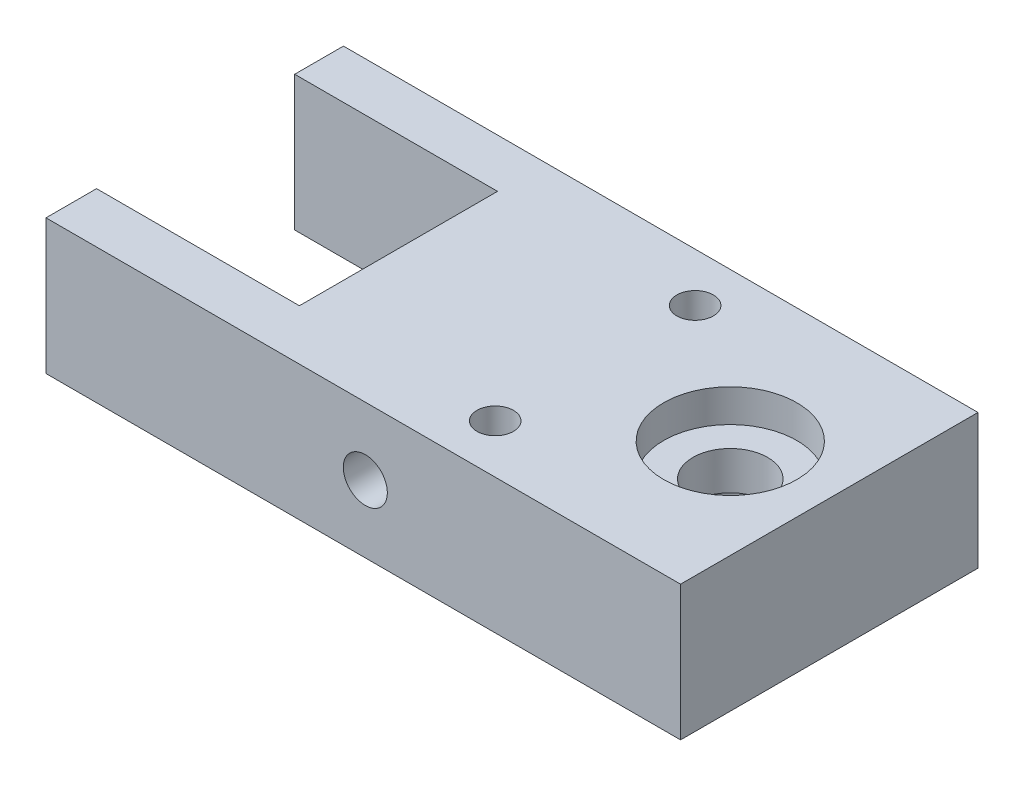
ISO-10303-21;
HEADER;
FILE_DESCRIPTION(('STEP AP214'),'2;1');
FILE_NAME('part.step','',(''),(''),'','','');
FILE_SCHEMA(('AUTOMOTIVE_DESIGN { 1 0 10303 214 1 1 1 1 }'));
ENDSEC;
DATA;
#1=APPLICATION_CONTEXT('core data for automotive mechanical design processes');
#2=APPLICATION_PROTOCOL_DEFINITION('international standard','automotive_design',2000,#1);
#3=PRODUCT_CONTEXT('',#1,'mechanical');
#4=PRODUCT('Part','Part','',(#3));
#5=PRODUCT_RELATED_PRODUCT_CATEGORY('part','',(#4));
#6=PRODUCT_DEFINITION_FORMATION('','',#4);
#7=PRODUCT_DEFINITION_CONTEXT('part definition',#1,'design');
#8=PRODUCT_DEFINITION('design','',#6,#7);
#9=PRODUCT_DEFINITION_SHAPE('','',#8);
#10=(LENGTH_UNIT() NAMED_UNIT(*) SI_UNIT(.MILLI.,.METRE.));
#11=(NAMED_UNIT(*) PLANE_ANGLE_UNIT() SI_UNIT($,.RADIAN.));
#12=(NAMED_UNIT(*) SI_UNIT($,.STERADIAN.) SOLID_ANGLE_UNIT());
#13=UNCERTAINTY_MEASURE_WITH_UNIT(LENGTH_MEASURE(1.E-05),#10,'distance_accuracy_value','');
#14=(GEOMETRIC_REPRESENTATION_CONTEXT(3) GLOBAL_UNCERTAINTY_ASSIGNED_CONTEXT((#13)) GLOBAL_UNIT_ASSIGNED_CONTEXT((#10,
#11,#12)) REPRESENTATION_CONTEXT('',''));
#15=CARTESIAN_POINT('',(0.,0.,0.));
#16=DIRECTION('',(0.,0.,1.));
#17=DIRECTION('',(1.,0.,0.));
#18=AXIS2_PLACEMENT_3D('',#15,#16,#17);
#19=CARTESIAN_POINT('',(0.,12.86,0.));
#20=DIRECTION('',(0.,-1.,0.));
#21=DIRECTION('',(0.,0.,-1.));
#22=AXIS2_PLACEMENT_3D('',#19,#20,#21);
#23=CYLINDRICAL_SURFACE('',#22,3.56);
#24=CARTESIAN_POINT('',(0.,9.74,0.));
#25=DIRECTION('',(0.,1.,0.));
#26=DIRECTION('',(0.,0.,1.));
#27=AXIS2_PLACEMENT_3D('',#24,#25,#26);
#28=CIRCLE('',#27,3.56);
#29=CARTESIAN_POINT('',(0.,9.74,3.56));
#30=VERTEX_POINT('',#29);
#31=EDGE_CURVE('E158',#30,#30,#28,.T.);
#32=ORIENTED_EDGE('',*,*,#31,.T.);
#33=EDGE_LOOP('',(#32));
#34=FACE_BOUND('',#33,.T.);
#35=CARTESIAN_POINT('',(0.,6.08,0.));
#36=DIRECTION('',(0.,-1.,0.));
#37=DIRECTION('',(0.,0.,-1.));
#38=AXIS2_PLACEMENT_3D('',#35,#36,#37);
#39=CIRCLE('',#38,3.56);
#40=CARTESIAN_POINT('',(0.,6.08,-3.56));
#41=VERTEX_POINT('',#40);
#42=EDGE_CURVE('E37',#41,#41,#39,.T.);
#43=ORIENTED_EDGE('',*,*,#42,.T.);
#44=EDGE_LOOP('',(#43));
#45=FACE_BOUND('',#44,.T.);
#46=ADVANCED_FACE('F33',(#34,#45),#23,.F.);
#47=CARTESIAN_POINT('',(-31.72,12.86,-9.52999999999999));
#48=DIRECTION('',(0.,-1.,0.));
#49=DIRECTION('',(0.,0.,-1.));
#50=AXIS2_PLACEMENT_3D('',#47,#48,#49);
#51=PLANE('',#50);
#52=CARTESIAN_POINT('',(-12.88,12.86,9.53));
#53=DIRECTION('',(0.,-1.,0.));
#54=DIRECTION('',(0.,0.,-1.));
#55=AXIS2_PLACEMENT_3D('',#52,#53,#54);
#56=CIRCLE('',#55,1.74);
#57=CARTESIAN_POINT('',(-12.88,12.86,7.79));
#58=VERTEX_POINT('',#57);
#59=EDGE_CURVE('E247',#58,#58,#56,.T.);
#60=ORIENTED_EDGE('',*,*,#59,.T.);
#61=EDGE_LOOP('',(#60));
#62=FACE_BOUND('',#61,.T.);
#63=CARTESIAN_POINT('',(-12.88,12.86,-9.53));
#64=DIRECTION('',(0.,-1.,0.));
#65=DIRECTION('',(0.,0.,-1.));
#66=AXIS2_PLACEMENT_3D('',#63,#64,#65);
#67=CIRCLE('',#66,1.74);
#68=CARTESIAN_POINT('',(-12.88,12.86,-11.27));
#69=VERTEX_POINT('',#68);
#70=EDGE_CURVE('E241',#69,#69,#67,.T.);
#71=ORIENTED_EDGE('',*,*,#70,.T.);
#72=EDGE_LOOP('',(#71));
#73=FACE_BOUND('',#72,.T.);
#74=CARTESIAN_POINT('',(0.,12.86,0.));
#75=DIRECTION('',(0.,1.,0.));
#76=DIRECTION('',(0.,0.,1.));
#77=AXIS2_PLACEMENT_3D('',#74,#75,#76);
#78=CIRCLE('',#77,6.35);
#79=CARTESIAN_POINT('',(0.,12.86,6.35));
#80=VERTEX_POINT('',#79);
#81=EDGE_CURVE('E167',#80,#80,#78,.T.);
#82=ORIENTED_EDGE('',*,*,#81,.F.);
#83=EDGE_LOOP('',(#82));
#84=FACE_BOUND('',#83,.T.);
#85=DIRECTION('',(1.,0.,0.));
#86=VECTOR('',#85,1.);
#87=CARTESIAN_POINT('',(-51.06,12.86,-9.52999999999999));
#88=LINE('',#87,#86);
#89=CARTESIAN_POINT('',(-51.06,12.86,-9.52999999999999));
#90=VERTEX_POINT('',#89);
#91=CARTESIAN_POINT('',(-31.72,12.86,-9.52999999999999));
#92=VERTEX_POINT('',#91);
#93=EDGE_CURVE('E147',#90,#92,#88,.T.);
#94=ORIENTED_EDGE('',*,*,#93,.T.);
#95=DIRECTION('',(0.,0.,1.));
#96=VECTOR('',#95,1.);
#97=CARTESIAN_POINT('',(-31.72,12.86,-9.52999999999999));
#98=LINE('',#97,#96);
#99=CARTESIAN_POINT('',(-31.72,12.86,9.36));
#100=VERTEX_POINT('',#99);
#101=EDGE_CURVE('E95',#92,#100,#98,.T.);
#102=ORIENTED_EDGE('',*,*,#101,.T.);
#103=DIRECTION('',(-1.,0.,0.));
#104=VECTOR('',#103,1.);
#105=CARTESIAN_POINT('',(-31.72,12.86,9.36));
#106=LINE('',#105,#104);
#107=CARTESIAN_POINT('',(-51.06,12.86,9.36000000000001));
#108=VERTEX_POINT('',#107);
#109=EDGE_CURVE('E181',#100,#108,#106,.T.);
#110=ORIENTED_EDGE('',*,*,#109,.T.);
#111=DIRECTION('',(0.,0.,1.));
#112=VECTOR('',#111,1.);
#113=CARTESIAN_POINT('',(-51.06,12.86,9.36000000000001));
#114=LINE('',#113,#112);
#115=CARTESIAN_POINT('',(-51.06,12.86,14.18));
#116=VERTEX_POINT('',#115);
#117=EDGE_CURVE('E183',#108,#116,#114,.T.);
#118=ORIENTED_EDGE('',*,*,#117,.T.);
#119=DIRECTION('',(1.,0.,0.));
#120=VECTOR('',#119,1.);
#121=CARTESIAN_POINT('',(-51.06,12.86,14.18));
#122=LINE('',#121,#120);
#123=CARTESIAN_POINT('',(9.43999999999999,12.86,14.18));
#124=VERTEX_POINT('',#123);
#125=EDGE_CURVE('E114',#116,#124,#122,.T.);
#126=ORIENTED_EDGE('',*,*,#125,.T.);
#127=DIRECTION('',(0.,0.,-1.));
#128=VECTOR('',#127,1.);
#129=CARTESIAN_POINT('',(9.43999999999999,12.86,14.18));
#130=LINE('',#129,#128);
#131=CARTESIAN_POINT('',(9.43999999999998,12.86,-14.18));
#132=VERTEX_POINT('',#131);
#133=EDGE_CURVE('E108',#124,#132,#130,.T.);
#134=ORIENTED_EDGE('',*,*,#133,.T.);
#135=DIRECTION('',(-1.,0.,0.));
#136=VECTOR('',#135,1.);
#137=CARTESIAN_POINT('',(9.43999999999998,12.86,-14.18));
#138=LINE('',#137,#136);
#139=CARTESIAN_POINT('',(-51.06,12.86,-14.18));
#140=VERTEX_POINT('',#139);
#141=EDGE_CURVE('E112',#132,#140,#138,.T.);
#142=ORIENTED_EDGE('',*,*,#141,.T.);
#143=DIRECTION('',(0.,0.,1.));
#144=VECTOR('',#143,1.);
#145=CARTESIAN_POINT('',(-51.06,12.86,-14.18));
#146=LINE('',#145,#144);
#147=EDGE_CURVE('E52',#140,#90,#146,.T.);
#148=ORIENTED_EDGE('',*,*,#147,.T.);
#149=EDGE_LOOP('',(#94,#102,#110,#118,#126,#134,#142,#148));
#150=FACE_BOUND('',#149,.T.);
#151=ADVANCED_FACE('F110',(#62,#73,#84,#150),#51,.F.);
#152=CARTESIAN_POINT('',(-31.72,0.,-9.52999999999999));
#153=DIRECTION('',(0.,-1.,0.));
#154=DIRECTION('',(0.,0.,-1.));
#155=AXIS2_PLACEMENT_3D('',#152,#153,#154);
#156=PLANE('',#155);
#157=CARTESIAN_POINT('',(-12.88,0.,9.53));
#158=DIRECTION('',(0.,-1.,0.));
#159=DIRECTION('',(0.,0.,-1.));
#160=AXIS2_PLACEMENT_3D('',#157,#158,#159);
#161=CIRCLE('',#160,1.74);
#162=CARTESIAN_POINT('',(-12.88,0.,7.79));
#163=VERTEX_POINT('',#162);
#164=EDGE_CURVE('E232',#163,#163,#161,.T.);
#165=ORIENTED_EDGE('',*,*,#164,.F.);
#166=EDGE_LOOP('',(#165));
#167=FACE_BOUND('',#166,.T.);
#168=CARTESIAN_POINT('',(-12.88,0.,-9.53));
#169=DIRECTION('',(0.,-1.,0.));
#170=DIRECTION('',(0.,0.,-1.));
#171=AXIS2_PLACEMENT_3D('',#168,#169,#170);
#172=CIRCLE('',#171,1.74);
#173=CARTESIAN_POINT('',(-12.88,0.,-11.27));
#174=VERTEX_POINT('',#173);
#175=EDGE_CURVE('E236',#174,#174,#172,.T.);
#176=ORIENTED_EDGE('',*,*,#175,.F.);
#177=EDGE_LOOP('',(#176));
#178=FACE_BOUND('',#177,.T.);
#179=CARTESIAN_POINT('',(0.,0.,0.));
#180=DIRECTION('',(0.,-1.,0.));
#181=DIRECTION('',(0.,0.,-1.));
#182=AXIS2_PLACEMENT_3D('',#179,#180,#181);
#183=CIRCLE('',#182,5.57);
#184=CARTESIAN_POINT('',(0.,0.,-5.57));
#185=VERTEX_POINT('',#184);
#186=EDGE_CURVE('E174',#185,#185,#183,.T.);
#187=ORIENTED_EDGE('',*,*,#186,.F.);
#188=EDGE_LOOP('',(#187));
#189=FACE_BOUND('',#188,.T.);
#190=DIRECTION('',(1.,0.,0.));
#191=VECTOR('',#190,1.);
#192=CARTESIAN_POINT('',(-51.06,0.,-9.52999999999999));
#193=LINE('',#192,#191);
#194=CARTESIAN_POINT('',(-51.06,0.,-9.52999999999999));
#195=VERTEX_POINT('',#194);
#196=CARTESIAN_POINT('',(-31.72,0.,-9.52999999999999));
#197=VERTEX_POINT('',#196);
#198=EDGE_CURVE('E132',#195,#197,#193,.T.);
#199=ORIENTED_EDGE('',*,*,#198,.F.);
#200=DIRECTION('',(0.,0.,1.));
#201=VECTOR('',#200,1.);
#202=CARTESIAN_POINT('',(-51.06,0.,-14.18));
#203=LINE('',#202,#201);
#204=CARTESIAN_POINT('',(-51.06,0.,-14.18));
#205=VERTEX_POINT('',#204);
#206=EDGE_CURVE('E87',#205,#195,#203,.T.);
#207=ORIENTED_EDGE('',*,*,#206,.F.);
#208=DIRECTION('',(-1.,0.,0.));
#209=VECTOR('',#208,1.);
#210=CARTESIAN_POINT('',(9.43999999999998,0.,-14.18));
#211=LINE('',#210,#209);
#212=CARTESIAN_POINT('',(9.43999999999998,0.,-14.18));
#213=VERTEX_POINT('',#212);
#214=EDGE_CURVE('E81',#213,#205,#211,.T.);
#215=ORIENTED_EDGE('',*,*,#214,.F.);
#216=DIRECTION('',(0.,0.,-1.));
#217=VECTOR('',#216,1.);
#218=CARTESIAN_POINT('',(9.43999999999999,0.,14.18));
#219=LINE('',#218,#217);
#220=CARTESIAN_POINT('',(9.43999999999999,0.,14.18));
#221=VERTEX_POINT('',#220);
#222=EDGE_CURVE('E122',#221,#213,#219,.T.);
#223=ORIENTED_EDGE('',*,*,#222,.F.);
#224=DIRECTION('',(1.,0.,0.));
#225=VECTOR('',#224,1.);
#226=CARTESIAN_POINT('',(-51.06,0.,14.18));
#227=LINE('',#226,#225);
#228=CARTESIAN_POINT('',(-51.06,0.,14.18));
#229=VERTEX_POINT('',#228);
#230=EDGE_CURVE('E142',#229,#221,#227,.T.);
#231=ORIENTED_EDGE('',*,*,#230,.F.);
#232=DIRECTION('',(0.,0.,1.));
#233=VECTOR('',#232,1.);
#234=CARTESIAN_POINT('',(-51.06,0.,9.36000000000001));
#235=LINE('',#234,#233);
#236=CARTESIAN_POINT('',(-51.06,0.,9.36000000000001));
#237=VERTEX_POINT('',#236);
#238=EDGE_CURVE('E140',#237,#229,#235,.T.);
#239=ORIENTED_EDGE('',*,*,#238,.F.);
#240=DIRECTION('',(-1.,0.,0.));
#241=VECTOR('',#240,1.);
#242=CARTESIAN_POINT('',(-31.72,0.,9.36));
#243=LINE('',#242,#241);
#244=CARTESIAN_POINT('',(-31.72,0.,9.36));
#245=VERTEX_POINT('',#244);
#246=EDGE_CURVE('E138',#245,#237,#243,.T.);
#247=ORIENTED_EDGE('',*,*,#246,.F.);
#248=DIRECTION('',(0.,0.,1.));
#249=VECTOR('',#248,1.);
#250=CARTESIAN_POINT('',(-31.72,0.,-9.52999999999999));
#251=LINE('',#250,#249);
#252=EDGE_CURVE('E135',#197,#245,#251,.T.);
#253=ORIENTED_EDGE('',*,*,#252,.F.);
#254=EDGE_LOOP('',(#199,#207,#215,#223,#231,#239,#247,#253));
#255=FACE_BOUND('',#254,.T.);
#256=ADVANCED_FACE('F196',(#167,#178,#189,#255),#156,.T.);
#257=CARTESIAN_POINT('',(-51.06,12.86,-9.52999999999999));
#258=DIRECTION('',(0.,0.,-1.));
#259=DIRECTION('',(-1.,0.,0.));
#260=AXIS2_PLACEMENT_3D('',#257,#258,#259);
#261=PLANE('',#260);
#262=ORIENTED_EDGE('',*,*,#198,.T.);
#263=DIRECTION('',(0.,-1.,0.));
#264=VECTOR('',#263,1.);
#265=CARTESIAN_POINT('',(-31.72,12.86,-9.52999999999999));
#266=LINE('',#265,#264);
#267=EDGE_CURVE('E11',#92,#197,#266,.T.);
#268=ORIENTED_EDGE('',*,*,#267,.F.);
#269=ORIENTED_EDGE('',*,*,#93,.F.);
#270=DIRECTION('',(0.,-1.,0.));
#271=VECTOR('',#270,1.);
#272=CARTESIAN_POINT('',(-51.06,12.86,-9.52999999999999));
#273=LINE('',#272,#271);
#274=EDGE_CURVE('E128',#90,#195,#273,.T.);
#275=ORIENTED_EDGE('',*,*,#274,.T.);
#276=EDGE_LOOP('',(#262,#268,#269,#275));
#277=FACE_BOUND('',#276,.T.);
#278=ADVANCED_FACE('F35',(#277),#261,.F.);
#279=CARTESIAN_POINT('',(-31.72,12.86,-9.52999999999999));
#280=DIRECTION('',(1.,0.,0.));
#281=DIRECTION('',(0.,0.,-1.));
#282=AXIS2_PLACEMENT_3D('',#279,#280,#281);
#283=PLANE('',#282);
#284=CARTESIAN_POINT('',(-31.72,6.43,-0.0849999999999939));
#285=DIRECTION('',(-1.,0.,0.));
#286=DIRECTION('',(0.,0.,1.));
#287=AXIS2_PLACEMENT_3D('',#284,#285,#286);
#288=CIRCLE('',#287,2.085);
#289=CARTESIAN_POINT('',(-31.72,6.43,2.00000000000001));
#290=VERTEX_POINT('',#289);
#291=EDGE_CURVE('E160',#290,#290,#288,.T.);
#292=ORIENTED_EDGE('',*,*,#291,.F.);
#293=EDGE_LOOP('',(#292));
#294=FACE_BOUND('',#293,.T.);
#295=ORIENTED_EDGE('',*,*,#252,.T.);
#296=DIRECTION('',(0.,-1.,0.));
#297=VECTOR('',#296,1.);
#298=CARTESIAN_POINT('',(-31.72,12.86,9.36));
#299=LINE('',#298,#297);
#300=EDGE_CURVE('E43',#100,#245,#299,.T.);
#301=ORIENTED_EDGE('',*,*,#300,.F.);
#302=ORIENTED_EDGE('',*,*,#101,.F.);
#303=ORIENTED_EDGE('',*,*,#267,.T.);
#304=EDGE_LOOP('',(#295,#301,#302,#303));
#305=FACE_BOUND('',#304,.T.);
#306=ADVANCED_FACE('F228',(#294,#305),#283,.F.);
#307=CARTESIAN_POINT('',(-31.72,12.86,9.36));
#308=DIRECTION('',(0.,0.,1.));
#309=DIRECTION('',(1.,0.,0.));
#310=AXIS2_PLACEMENT_3D('',#307,#308,#309);
#311=PLANE('',#310);
#312=ORIENTED_EDGE('',*,*,#246,.T.);
#313=DIRECTION('',(0.,-1.,0.));
#314=VECTOR('',#313,1.);
#315=CARTESIAN_POINT('',(-51.06,12.86,9.36000000000001));
#316=LINE('',#315,#314);
#317=EDGE_CURVE('E154',#108,#237,#316,.T.);
#318=ORIENTED_EDGE('',*,*,#317,.F.);
#319=ORIENTED_EDGE('',*,*,#109,.F.);
#320=ORIENTED_EDGE('',*,*,#300,.T.);
#321=EDGE_LOOP('',(#312,#318,#319,#320));
#322=FACE_BOUND('',#321,.T.);
#323=ADVANCED_FACE('F276',(#322),#311,.F.);
#324=CARTESIAN_POINT('',(-51.06,12.86,9.36000000000001));
#325=DIRECTION('',(1.,0.,0.));
#326=DIRECTION('',(0.,0.,-1.));
#327=AXIS2_PLACEMENT_3D('',#324,#325,#326);
#328=PLANE('',#327);
#329=ORIENTED_EDGE('',*,*,#238,.T.);
#330=DIRECTION('',(0.,-1.,0.));
#331=VECTOR('',#330,1.);
#332=CARTESIAN_POINT('',(-51.06,12.86,14.18));
#333=LINE('',#332,#331);
#334=EDGE_CURVE('E151',#116,#229,#333,.T.);
#335=ORIENTED_EDGE('',*,*,#334,.F.);
#336=ORIENTED_EDGE('',*,*,#117,.F.);
#337=ORIENTED_EDGE('',*,*,#317,.T.);
#338=EDGE_LOOP('',(#329,#335,#336,#337));
#339=FACE_BOUND('',#338,.T.);
#340=ADVANCED_FACE('F189',(#339),#328,.F.);
#341=CARTESIAN_POINT('',(-51.06,12.86,14.18));
#342=DIRECTION('',(0.,0.,-1.));
#343=DIRECTION('',(-1.,0.,0.));
#344=AXIS2_PLACEMENT_3D('',#341,#342,#343);
#345=PLANE('',#344);
#346=CARTESIAN_POINT('',(-20.615,6.43,14.18));
#347=DIRECTION('',(0.,0.,1.));
#348=DIRECTION('',(1.,0.,0.));
#349=AXIS2_PLACEMENT_3D('',#346,#347,#348);
#350=CIRCLE('',#349,2.1);
#351=CARTESIAN_POINT('',(-18.515,6.43,14.18));
#352=VERTEX_POINT('',#351);
#353=EDGE_CURVE('E254',#352,#352,#350,.T.);
#354=ORIENTED_EDGE('',*,*,#353,.F.);
#355=EDGE_LOOP('',(#354));
#356=FACE_BOUND('',#355,.T.);
#357=ORIENTED_EDGE('',*,*,#230,.T.);
#358=DIRECTION('',(0.,-1.,0.));
#359=VECTOR('',#358,1.);
#360=CARTESIAN_POINT('',(9.43999999999999,12.86,14.18));
#361=LINE('',#360,#359);
#362=EDGE_CURVE('E123',#124,#221,#361,.T.);
#363=ORIENTED_EDGE('',*,*,#362,.F.);
#364=ORIENTED_EDGE('',*,*,#125,.F.);
#365=ORIENTED_EDGE('',*,*,#334,.T.);
#366=EDGE_LOOP('',(#357,#363,#364,#365));
#367=FACE_BOUND('',#366,.T.);
#368=ADVANCED_FACE('F193',(#356,#367),#345,.F.);
#369=CARTESIAN_POINT('',(9.43999999999999,12.86,14.18));
#370=DIRECTION('',(-1.,0.,0.));
#371=DIRECTION('',(0.,0.,1.));
#372=AXIS2_PLACEMENT_3D('',#369,#370,#371);
#373=PLANE('',#372);
#374=ORIENTED_EDGE('',*,*,#222,.T.);
#375=DIRECTION('',(0.,-1.,0.));
#376=VECTOR('',#375,1.);
#377=CARTESIAN_POINT('',(9.43999999999998,12.86,-14.18));
#378=LINE('',#377,#376);
#379=EDGE_CURVE('E119',#132,#213,#378,.T.);
#380=ORIENTED_EDGE('',*,*,#379,.F.);
#381=ORIENTED_EDGE('',*,*,#133,.F.);
#382=ORIENTED_EDGE('',*,*,#362,.T.);
#383=EDGE_LOOP('',(#374,#380,#381,#382));
#384=FACE_BOUND('',#383,.T.);
#385=ADVANCED_FACE('F120',(#384),#373,.F.);
#386=CARTESIAN_POINT('',(9.43999999999998,12.86,-14.18));
#387=DIRECTION('',(0.,0.,1.));
#388=DIRECTION('',(1.,0.,0.));
#389=AXIS2_PLACEMENT_3D('',#386,#387,#388);
#390=PLANE('',#389);
#391=ORIENTED_EDGE('',*,*,#214,.T.);
#392=DIRECTION('',(0.,-1.,0.));
#393=VECTOR('',#392,1.);
#394=CARTESIAN_POINT('',(-51.06,12.86,-14.18));
#395=LINE('',#394,#393);
#396=EDGE_CURVE('E124',#140,#205,#395,.T.);
#397=ORIENTED_EDGE('',*,*,#396,.F.);
#398=ORIENTED_EDGE('',*,*,#141,.F.);
#399=ORIENTED_EDGE('',*,*,#379,.T.);
#400=EDGE_LOOP('',(#391,#397,#398,#399));
#401=FACE_BOUND('',#400,.T.);
#402=ADVANCED_FACE('F126',(#401),#390,.F.);
#403=CARTESIAN_POINT('',(-51.06,12.86,-14.18));
#404=DIRECTION('',(1.,0.,0.));
#405=DIRECTION('',(0.,0.,-1.));
#406=AXIS2_PLACEMENT_3D('',#403,#404,#405);
#407=PLANE('',#406);
#408=ORIENTED_EDGE('',*,*,#206,.T.);
#409=ORIENTED_EDGE('',*,*,#274,.F.);
#410=ORIENTED_EDGE('',*,*,#147,.F.);
#411=ORIENTED_EDGE('',*,*,#396,.T.);
#412=EDGE_LOOP('',(#408,#409,#410,#411));
#413=FACE_BOUND('',#412,.T.);
#414=ADVANCED_FACE('F201',(#413),#407,.F.);
#415=CARTESIAN_POINT('',(-19.02,6.43,-0.0849999999999939));
#416=DIRECTION('',(-1.,0.,0.));
#417=DIRECTION('',(0.,0.,1.));
#418=AXIS2_PLACEMENT_3D('',#415,#416,#417);
#419=CYLINDRICAL_SURFACE('',#418,2.085);
#420=CARTESIAN_POINT('',(-19.02,6.43,-0.0849999999999939));
#421=DIRECTION('',(-1.,0.,0.));
#422=DIRECTION('',(0.,0.,1.));
#423=AXIS2_PLACEMENT_3D('',#420,#421,#422);
#424=CIRCLE('',#423,2.085);
#425=CARTESIAN_POINT('',(-19.02,6.43,2.00000000000001));
#426=VERTEX_POINT('',#425);
#427=EDGE_CURVE('E136',#426,#426,#424,.T.);
#428=ORIENTED_EDGE('',*,*,#427,.F.);
#429=EDGE_LOOP('',(#428));
#430=FACE_BOUND('',#429,.T.);
#431=ORIENTED_EDGE('',*,*,#291,.T.);
#432=EDGE_LOOP('',(#431));
#433=FACE_BOUND('',#432,.T.);
#434=ADVANCED_FACE('F203',(#430,#433),#419,.F.);
#435=CARTESIAN_POINT('',(-19.02,6.43,-0.0849999999999939));
#436=DIRECTION('',(-1.,0.,0.));
#437=DIRECTION('',(0.,0.,1.));
#438=AXIS2_PLACEMENT_3D('',#435,#436,#437);
#439=PLANE('',#438);
#440=ORIENTED_EDGE('',*,*,#427,.T.);
#441=EDGE_LOOP('',(#440));
#442=FACE_BOUND('',#441,.T.);
#443=ADVANCED_FACE('F209',(#442),#439,.T.);
#444=CARTESIAN_POINT('',(0.,9.74,0.));
#445=DIRECTION('',(0.,1.,0.));
#446=DIRECTION('',(0.,0.,1.));
#447=AXIS2_PLACEMENT_3D('',#444,#445,#446);
#448=CYLINDRICAL_SURFACE('',#447,6.35);
#449=CARTESIAN_POINT('',(0.,9.74,0.));
#450=DIRECTION('',(0.,1.,0.));
#451=DIRECTION('',(0.,0.,1.));
#452=AXIS2_PLACEMENT_3D('',#449,#450,#451);
#453=CIRCLE('',#452,6.35);
#454=CARTESIAN_POINT('',(0.,9.74,6.35));
#455=VERTEX_POINT('',#454);
#456=EDGE_CURVE('E161',#455,#455,#453,.T.);
#457=ORIENTED_EDGE('',*,*,#456,.F.);
#458=EDGE_LOOP('',(#457));
#459=FACE_BOUND('',#458,.T.);
#460=ORIENTED_EDGE('',*,*,#81,.T.);
#461=EDGE_LOOP('',(#460));
#462=FACE_BOUND('',#461,.T.);
#463=ADVANCED_FACE('F329',(#459,#462),#448,.F.);
#464=CARTESIAN_POINT('',(0.,9.74,0.));
#465=DIRECTION('',(0.,1.,0.));
#466=DIRECTION('',(0.,0.,1.));
#467=AXIS2_PLACEMENT_3D('',#464,#465,#466);
#468=PLANE('',#467);
#469=ORIENTED_EDGE('',*,*,#31,.F.);
#470=EDGE_LOOP('',(#469));
#471=FACE_BOUND('',#470,.T.);
#472=ORIENTED_EDGE('',*,*,#456,.T.);
#473=EDGE_LOOP('',(#472));
#474=FACE_BOUND('',#473,.T.);
#475=ADVANCED_FACE('F337',(#471,#474),#468,.T.);
#476=CARTESIAN_POINT('',(0.,6.08,0.));
#477=DIRECTION('',(0.,-1.,0.));
#478=DIRECTION('',(0.,0.,-1.));
#479=AXIS2_PLACEMENT_3D('',#476,#477,#478);
#480=CYLINDRICAL_SURFACE('',#479,5.57);
#481=CARTESIAN_POINT('',(0.,6.08,0.));
#482=DIRECTION('',(0.,-1.,0.));
#483=DIRECTION('',(0.,0.,-1.));
#484=AXIS2_PLACEMENT_3D('',#481,#482,#483);
#485=CIRCLE('',#484,5.57);
#486=CARTESIAN_POINT('',(0.,6.08,-5.57));
#487=VERTEX_POINT('',#486);
#488=EDGE_CURVE('E240',#487,#487,#485,.T.);
#489=ORIENTED_EDGE('',*,*,#488,.F.);
#490=EDGE_LOOP('',(#489));
#491=FACE_BOUND('',#490,.T.);
#492=ORIENTED_EDGE('',*,*,#186,.T.);
#493=EDGE_LOOP('',(#492));
#494=FACE_BOUND('',#493,.T.);
#495=ADVANCED_FACE('F346',(#491,#494),#480,.F.);
#496=CARTESIAN_POINT('',(0.,6.08,0.));
#497=DIRECTION('',(0.,-1.,0.));
#498=DIRECTION('',(0.,0.,-1.));
#499=AXIS2_PLACEMENT_3D('',#496,#497,#498);
#500=PLANE('',#499);
#501=ORIENTED_EDGE('',*,*,#42,.F.);
#502=EDGE_LOOP('',(#501));
#503=FACE_BOUND('',#502,.T.);
#504=ORIENTED_EDGE('',*,*,#488,.T.);
#505=EDGE_LOOP('',(#504));
#506=FACE_BOUND('',#505,.T.);
#507=ADVANCED_FACE('F359',(#503,#506),#500,.T.);
#508=CARTESIAN_POINT('',(-12.88,12.86,-9.53));
#509=DIRECTION('',(0.,-1.,0.));
#510=DIRECTION('',(0.,0.,-1.));
#511=AXIS2_PLACEMENT_3D('',#508,#509,#510);
#512=CYLINDRICAL_SURFACE('',#511,1.74);
#513=ORIENTED_EDGE('',*,*,#70,.F.);
#514=EDGE_LOOP('',(#513));
#515=FACE_BOUND('',#514,.T.);
#516=ORIENTED_EDGE('',*,*,#175,.T.);
#517=EDGE_LOOP('',(#516));
#518=FACE_BOUND('',#517,.T.);
#519=ADVANCED_FACE('F368',(#515,#518),#512,.F.);
#520=CARTESIAN_POINT('',(-12.88,12.86,9.53));
#521=DIRECTION('',(0.,-1.,0.));
#522=DIRECTION('',(0.,0.,-1.));
#523=AXIS2_PLACEMENT_3D('',#520,#521,#522);
#524=CYLINDRICAL_SURFACE('',#523,1.74);
#525=ORIENTED_EDGE('',*,*,#59,.F.);
#526=EDGE_LOOP('',(#525));
#527=FACE_BOUND('',#526,.T.);
#528=ORIENTED_EDGE('',*,*,#164,.T.);
#529=EDGE_LOOP('',(#528));
#530=FACE_BOUND('',#529,.T.);
#531=ADVANCED_FACE('F265',(#527,#530),#524,.F.);
#532=CARTESIAN_POINT('',(-20.615,6.43,4.18));
#533=DIRECTION('',(0.,0.,1.));
#534=DIRECTION('',(1.,0.,0.));
#535=AXIS2_PLACEMENT_3D('',#532,#533,#534);
#536=CYLINDRICAL_SURFACE('',#535,2.1);
#537=CARTESIAN_POINT('',(-20.615,6.43,4.18));
#538=DIRECTION('',(0.,0.,1.));
#539=DIRECTION('',(1.,0.,0.));
#540=AXIS2_PLACEMENT_3D('',#537,#538,#539);
#541=CIRCLE('',#540,2.1);
#542=CARTESIAN_POINT('',(-18.515,6.43,4.18));
#543=VERTEX_POINT('',#542);
#544=EDGE_CURVE('E251',#543,#543,#541,.T.);
#545=ORIENTED_EDGE('',*,*,#544,.F.);
#546=EDGE_LOOP('',(#545));
#547=FACE_BOUND('',#546,.T.);
#548=ORIENTED_EDGE('',*,*,#353,.T.);
#549=EDGE_LOOP('',(#548));
#550=FACE_BOUND('',#549,.T.);
#551=ADVANCED_FACE('F262',(#547,#550),#536,.F.);
#552=CARTESIAN_POINT('',(-20.615,6.43,4.18));
#553=DIRECTION('',(0.,0.,1.));
#554=DIRECTION('',(1.,0.,0.));
#555=AXIS2_PLACEMENT_3D('',#552,#553,#554);
#556=PLANE('',#555);
#557=ORIENTED_EDGE('',*,*,#544,.T.);
#558=EDGE_LOOP('',(#557));
#559=FACE_BOUND('',#558,.T.);
#560=ADVANCED_FACE('F260',(#559),#556,.T.);
#561=CLOSED_SHELL('',(#46,#151,#256,#278,#306,#323,#340,#368,#385,#402,#414,#434,#443,#463,#475,
#495,#507,#519,#531,#551,#560));
#562=MANIFOLD_SOLID_BREP('B2',#561);
#563=ADVANCED_BREP_SHAPE_REPRESENTATION('',(#18,#562),#14);
#564=SHAPE_DEFINITION_REPRESENTATION(#9,#563);
ENDSEC;
END-ISO-10303-21;
